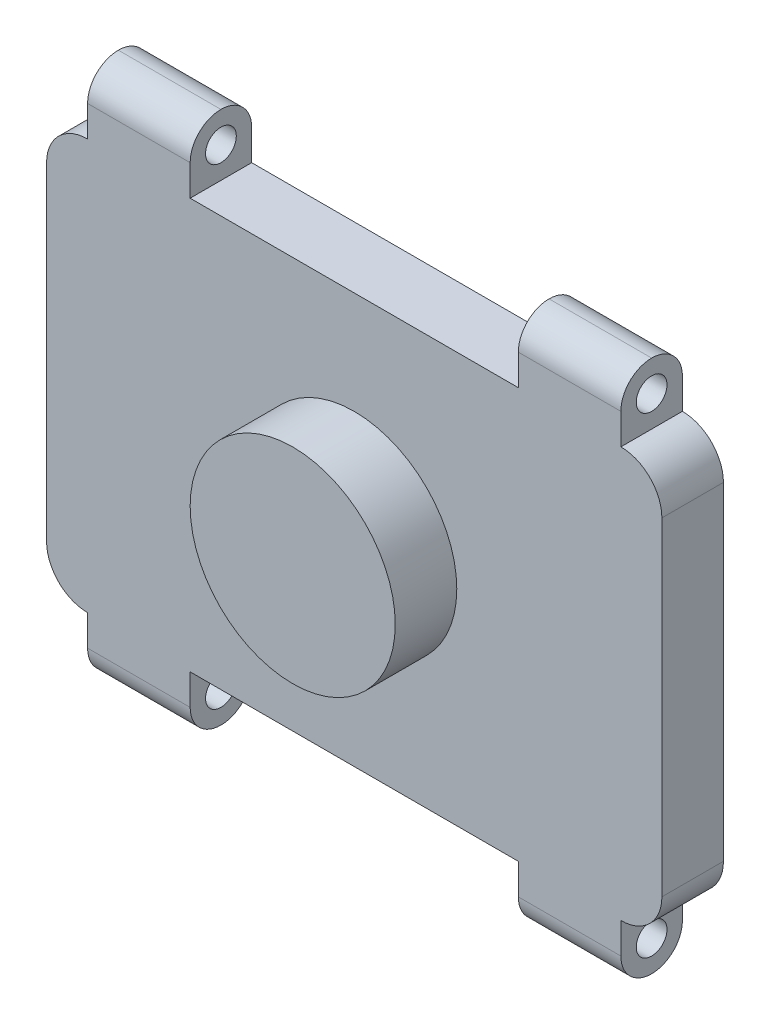
ISO-10303-21;
HEADER;
FILE_DESCRIPTION(('STEP AP214'),'2;1');
FILE_NAME('part.step','',(''),(''),'','','');
FILE_SCHEMA(('AUTOMOTIVE_DESIGN { 1 0 10303 214 1 1 1 1 }'));
ENDSEC;
DATA;
#1=APPLICATION_CONTEXT('core data for automotive mechanical design processes');
#2=APPLICATION_PROTOCOL_DEFINITION('international standard','automotive_design',2000,#1);
#3=PRODUCT_CONTEXT('',#1,'mechanical');
#4=PRODUCT('Part','Part','',(#3));
#5=PRODUCT_RELATED_PRODUCT_CATEGORY('part','',(#4));
#6=PRODUCT_DEFINITION_FORMATION('','',#4);
#7=PRODUCT_DEFINITION_CONTEXT('part definition',#1,'design');
#8=PRODUCT_DEFINITION('design','',#6,#7);
#9=PRODUCT_DEFINITION_SHAPE('','',#8);
#10=(LENGTH_UNIT() NAMED_UNIT(*) SI_UNIT(.MILLI.,.METRE.));
#11=(NAMED_UNIT(*) PLANE_ANGLE_UNIT() SI_UNIT($,.RADIAN.));
#12=(NAMED_UNIT(*) SI_UNIT($,.STERADIAN.) SOLID_ANGLE_UNIT());
#13=UNCERTAINTY_MEASURE_WITH_UNIT(LENGTH_MEASURE(1.E-05),#10,'distance_accuracy_value','');
#14=(GEOMETRIC_REPRESENTATION_CONTEXT(3) GLOBAL_UNCERTAINTY_ASSIGNED_CONTEXT((#13)) GLOBAL_UNIT_ASSIGNED_CONTEXT((#10,
#11,#12)) REPRESENTATION_CONTEXT('',''));
#15=CARTESIAN_POINT('',(0.,0.,0.));
#16=DIRECTION('',(0.,0.,1.));
#17=DIRECTION('',(1.,0.,0.));
#18=AXIS2_PLACEMENT_3D('',#15,#16,#17);
#19=CARTESIAN_POINT('',(-1654.84736029471,870.646766169154,300.));
#20=DIRECTION('',(1.,0.,0.));
#21=DIRECTION('',(0.,0.,-1.));
#22=AXIS2_PLACEMENT_3D('',#19,#20,#21);
#23=PLANE('',#22);
#24=DIRECTION('',(0.,-1.,0.));
#25=VECTOR('',#24,1.);
#26=CARTESIAN_POINT('',(-1654.84736029471,870.646766169154,0.));
#27=LINE('',#26,#25);
#28=CARTESIAN_POINT('',(-1654.84736029471,670.646766169154,0.));
#29=VERTEX_POINT('',#28);
#30=CARTESIAN_POINT('',(-1654.84736029471,-929.353233830846,0.));
#31=VERTEX_POINT('',#30);
#32=EDGE_CURVE('E274',#29,#31,#27,.T.);
#33=ORIENTED_EDGE('',*,*,#32,.T.);
#34=DIRECTION('',(0.,0.,-1.));
#35=VECTOR('',#34,1.);
#36=CARTESIAN_POINT('',(-1654.84736029471,-929.353233830846,300.));
#37=LINE('',#36,#35);
#38=CARTESIAN_POINT('',(-1654.84736029471,-929.353233830846,300.));
#39=VERTEX_POINT('',#38);
#40=EDGE_CURVE('E201',#31,#39,#37,.F.);
#41=ORIENTED_EDGE('',*,*,#40,.T.);
#42=DIRECTION('',(0.,-1.,0.));
#43=VECTOR('',#42,1.);
#44=CARTESIAN_POINT('',(-1654.84736029471,870.646766169154,300.));
#45=LINE('',#44,#43);
#46=CARTESIAN_POINT('',(-1654.84736029471,670.646766169154,300.));
#47=VERTEX_POINT('',#46);
#48=EDGE_CURVE('E275',#47,#39,#45,.T.);
#49=ORIENTED_EDGE('',*,*,#48,.F.);
#50=DIRECTION('',(0.,0.,-1.));
#51=VECTOR('',#50,1.);
#52=CARTESIAN_POINT('',(-1654.84736029471,670.646766169154,300.));
#53=LINE('',#52,#51);
#54=EDGE_CURVE('E206',#47,#29,#53,.T.);
#55=ORIENTED_EDGE('',*,*,#54,.T.);
#56=EDGE_LOOP('',(#33,#41,#49,#55));
#57=FACE_BOUND('',#56,.T.);
#58=ADVANCED_FACE('F33',(#57),#23,.F.);
#59=CARTESIAN_POINT('',(-1654.84736029471,-1129.35323383085,300.));
#60=DIRECTION('',(0.,1.,0.));
#61=DIRECTION('',(-1.,0.,0.));
#62=AXIS2_PLACEMENT_3D('',#59,#60,#61);
#63=PLANE('',#62);
#64=DIRECTION('',(1.,0.,0.));
#65=VECTOR('',#64,1.);
#66=CARTESIAN_POINT('',(-1654.84736029471,-1129.35323383085,300.));
#67=LINE('',#66,#65);
#68=CARTESIAN_POINT('',(-954.847360294714,-1129.35323383085,300.));
#69=VERTEX_POINT('',#68);
#70=CARTESIAN_POINT('',(645.152639705285,-1129.35323383085,300.));
#71=VERTEX_POINT('',#70);
#72=EDGE_CURVE('E278',#69,#71,#67,.T.);
#73=ORIENTED_EDGE('',*,*,#72,.F.);
#74=DIRECTION('',(0.,0.,1.));
#75=VECTOR('',#74,1.);
#76=CARTESIAN_POINT('',(-954.847360294714,-1129.35323383085,0.));
#77=LINE('',#76,#75);
#78=CARTESIAN_POINT('',(-954.847360294714,-1129.35323383085,0.));
#79=VERTEX_POINT('',#78);
#80=EDGE_CURVE('E226',#79,#69,#77,.T.);
#81=ORIENTED_EDGE('',*,*,#80,.F.);
#82=DIRECTION('',(1.,0.,0.));
#83=VECTOR('',#82,1.);
#84=CARTESIAN_POINT('',(-1654.84736029471,-1129.35323383085,0.));
#85=LINE('',#84,#83);
#86=CARTESIAN_POINT('',(645.152639705285,-1129.35323383085,0.));
#87=VERTEX_POINT('',#86);
#88=EDGE_CURVE('E287',#79,#87,#85,.T.);
#89=ORIENTED_EDGE('',*,*,#88,.T.);
#90=DIRECTION('',(0.,0.,1.));
#91=VECTOR('',#90,1.);
#92=CARTESIAN_POINT('',(645.152639705286,-1129.35323383085,0.));
#93=LINE('',#92,#91);
#94=EDGE_CURVE('E243',#87,#71,#93,.T.);
#95=ORIENTED_EDGE('',*,*,#94,.T.);
#96=EDGE_LOOP('',(#73,#81,#89,#95));
#97=FACE_BOUND('',#96,.T.);
#98=ADVANCED_FACE('F434',(#97),#63,.F.);
#99=CARTESIAN_POINT('',(1345.15263970529,870.646766169154,300.));
#100=DIRECTION('',(-1.,0.,0.));
#101=DIRECTION('',(0.,-1.,0.));
#102=AXIS2_PLACEMENT_3D('',#99,#100,#101);
#103=PLANE('',#102);
#104=DIRECTION('',(0.,1.,0.));
#105=VECTOR('',#104,1.);
#106=CARTESIAN_POINT('',(1345.15263970529,870.646766169154,300.));
#107=LINE('',#106,#105);
#108=CARTESIAN_POINT('',(1345.15263970529,-929.353233830845,300.));
#109=VERTEX_POINT('',#108);
#110=CARTESIAN_POINT('',(1345.15263970529,670.646766169154,300.));
#111=VERTEX_POINT('',#110);
#112=EDGE_CURVE('E281',#109,#111,#107,.T.);
#113=ORIENTED_EDGE('',*,*,#112,.F.);
#114=DIRECTION('',(0.,0.,-1.));
#115=VECTOR('',#114,1.);
#116=CARTESIAN_POINT('',(1345.15263970529,-929.353233830845,300.));
#117=LINE('',#116,#115);
#118=CARTESIAN_POINT('',(1345.15263970529,-929.353233830845,0.));
#119=VERTEX_POINT('',#118);
#120=EDGE_CURVE('E314',#109,#119,#117,.T.);
#121=ORIENTED_EDGE('',*,*,#120,.T.);
#122=DIRECTION('',(0.,1.,0.));
#123=VECTOR('',#122,1.);
#124=CARTESIAN_POINT('',(1345.15263970529,870.646766169154,0.));
#125=LINE('',#124,#123);
#126=CARTESIAN_POINT('',(1345.15263970529,670.646766169154,0.));
#127=VERTEX_POINT('',#126);
#128=EDGE_CURVE('E289',#119,#127,#125,.T.);
#129=ORIENTED_EDGE('',*,*,#128,.T.);
#130=DIRECTION('',(0.,0.,-1.));
#131=VECTOR('',#130,1.);
#132=CARTESIAN_POINT('',(1345.15263970529,670.646766169154,300.));
#133=LINE('',#132,#131);
#134=EDGE_CURVE('E312',#127,#111,#133,.F.);
#135=ORIENTED_EDGE('',*,*,#134,.T.);
#136=EDGE_LOOP('',(#113,#121,#129,#135));
#137=FACE_BOUND('',#136,.T.);
#138=ADVANCED_FACE('F440',(#137),#103,.F.);
#139=CARTESIAN_POINT('',(-1654.84736029471,870.646766169154,300.));
#140=DIRECTION('',(0.,-1.,0.));
#141=DIRECTION('',(0.,0.,-1.));
#142=AXIS2_PLACEMENT_3D('',#139,#140,#141);
#143=PLANE('',#142);
#144=DIRECTION('',(-1.,0.,0.));
#145=VECTOR('',#144,1.);
#146=CARTESIAN_POINT('',(-1654.84736029471,870.646766169154,300.));
#147=LINE('',#146,#145);
#148=CARTESIAN_POINT('',(645.152639705286,870.646766169154,300.));
#149=VERTEX_POINT('',#148);
#150=CARTESIAN_POINT('',(-954.847360294714,870.646766169154,300.));
#151=VERTEX_POINT('',#150);
#152=EDGE_CURVE('E284',#149,#151,#147,.T.);
#153=ORIENTED_EDGE('',*,*,#152,.F.);
#154=DIRECTION('',(0.,0.,1.));
#155=VECTOR('',#154,1.);
#156=CARTESIAN_POINT('',(645.152639705286,870.646766169154,0.));
#157=LINE('',#156,#155);
#158=CARTESIAN_POINT('',(645.152639705286,870.646766169154,0.));
#159=VERTEX_POINT('',#158);
#160=EDGE_CURVE('E256',#159,#149,#157,.T.);
#161=ORIENTED_EDGE('',*,*,#160,.F.);
#162=DIRECTION('',(-1.,0.,0.));
#163=VECTOR('',#162,1.);
#164=CARTESIAN_POINT('',(-1654.84736029471,870.646766169154,0.));
#165=LINE('',#164,#163);
#166=CARTESIAN_POINT('',(-954.847360294714,870.646766169154,0.));
#167=VERTEX_POINT('',#166);
#168=EDGE_CURVE('E279',#159,#167,#165,.T.);
#169=ORIENTED_EDGE('',*,*,#168,.T.);
#170=DIRECTION('',(0.,0.,1.));
#171=VECTOR('',#170,1.);
#172=CARTESIAN_POINT('',(-954.847360294714,870.646766169154,0.));
#173=LINE('',#172,#171);
#174=EDGE_CURVE('E268',#167,#151,#173,.T.);
#175=ORIENTED_EDGE('',*,*,#174,.T.);
#176=EDGE_LOOP('',(#153,#161,#169,#175));
#177=FACE_BOUND('',#176,.T.);
#178=ADVANCED_FACE('F496',(#177),#143,.F.);
#179=CARTESIAN_POINT('',(0.,0.,300.));
#180=DIRECTION('',(0.,0.,1.));
#181=DIRECTION('',(1.,0.,0.));
#182=AXIS2_PLACEMENT_3D('',#179,#180,#181);
#183=PLANE('',#182);
#184=CARTESIAN_POINT('',(-154.847360294714,-129.353233830846,300.));
#185=DIRECTION('',(0.,0.,1.));
#186=DIRECTION('',(1.,0.,0.));
#187=AXIS2_PLACEMENT_3D('',#184,#185,#186);
#188=CIRCLE('',#187,500.);
#189=CARTESIAN_POINT('',(345.152639705286,-129.353233830846,300.));
#190=VERTEX_POINT('',#189);
#191=EDGE_CURVE('E393',#190,#190,#188,.T.);
#192=ORIENTED_EDGE('',*,*,#191,.F.);
#193=EDGE_LOOP('',(#192));
#194=FACE_BOUND('',#193,.T.);
#195=DIRECTION('',(0.,-1.,0.));
#196=VECTOR('',#195,1.);
#197=CARTESIAN_POINT('',(-1454.84736029471,-1129.35323383085,300.));
#198=LINE('',#197,#196);
#199=CARTESIAN_POINT('',(-1454.84736029471,-1129.35323383085,300.));
#200=VERTEX_POINT('',#199);
#201=CARTESIAN_POINT('',(-1454.84736029471,-1279.35323383085,300.));
#202=VERTEX_POINT('',#201);
#203=EDGE_CURVE('E214',#200,#202,#198,.T.);
#204=ORIENTED_EDGE('',*,*,#203,.T.);
#205=DIRECTION('',(1.,0.,0.));
#206=VECTOR('',#205,1.);
#207=CARTESIAN_POINT('',(0.,-1279.35323383085,300.));
#208=LINE('',#207,#206);
#209=CARTESIAN_POINT('',(-954.847360294714,-1279.35323383085,300.));
#210=VERTEX_POINT('',#209);
#211=EDGE_CURVE('E357',#202,#210,#208,.T.);
#212=ORIENTED_EDGE('',*,*,#211,.T.);
#213=DIRECTION('',(0.,1.,0.));
#214=VECTOR('',#213,1.);
#215=CARTESIAN_POINT('',(-954.847360294714,-1129.35323383085,300.));
#216=LINE('',#215,#214);
#217=EDGE_CURVE('E224',#210,#69,#216,.T.);
#218=ORIENTED_EDGE('',*,*,#217,.T.);
#219=ORIENTED_EDGE('',*,*,#72,.T.);
#220=DIRECTION('',(0.,-1.,0.));
#221=VECTOR('',#220,1.);
#222=CARTESIAN_POINT('',(645.152639705286,-1129.35323383085,300.));
#223=LINE('',#222,#221);
#224=CARTESIAN_POINT('',(645.152639705286,-1279.35323383085,300.));
#225=VERTEX_POINT('',#224);
#226=EDGE_CURVE('E240',#71,#225,#223,.T.);
#227=ORIENTED_EDGE('',*,*,#226,.T.);
#228=DIRECTION('',(1.,0.,0.));
#229=VECTOR('',#228,1.);
#230=CARTESIAN_POINT('',(0.,-1279.35323383085,300.));
#231=LINE('',#230,#229);
#232=CARTESIAN_POINT('',(1145.15263970529,-1279.35323383085,300.));
#233=VERTEX_POINT('',#232);
#234=EDGE_CURVE('E355',#225,#233,#231,.T.);
#235=ORIENTED_EDGE('',*,*,#234,.T.);
#236=DIRECTION('',(0.,1.,0.));
#237=VECTOR('',#236,1.);
#238=CARTESIAN_POINT('',(1145.15263970529,-1129.35323383085,300.));
#239=LINE('',#238,#237);
#240=CARTESIAN_POINT('',(1145.15263970529,-1129.35323383085,300.));
#241=VERTEX_POINT('',#240);
#242=EDGE_CURVE('E236',#233,#241,#239,.T.);
#243=ORIENTED_EDGE('',*,*,#242,.T.);
#244=CARTESIAN_POINT('',(1145.15263970529,-929.353233830845,300.));
#245=DIRECTION('',(0.,0.,1.));
#246=DIRECTION('',(1.,0.,0.));
#247=AXIS2_PLACEMENT_3D('',#244,#245,#246);
#248=CIRCLE('',#247,200.);
#249=EDGE_CURVE('E308',#241,#109,#248,.T.);
#250=ORIENTED_EDGE('',*,*,#249,.T.);
#251=ORIENTED_EDGE('',*,*,#112,.T.);
#252=CARTESIAN_POINT('',(1145.15263970529,670.646766169154,300.));
#253=DIRECTION('',(0.,0.,1.));
#254=DIRECTION('',(1.,0.,0.));
#255=AXIS2_PLACEMENT_3D('',#252,#253,#254);
#256=CIRCLE('',#255,200.);
#257=CARTESIAN_POINT('',(1145.15263970529,870.646766169154,300.));
#258=VERTEX_POINT('',#257);
#259=EDGE_CURVE('E306',#111,#258,#256,.T.);
#260=ORIENTED_EDGE('',*,*,#259,.T.);
#261=DIRECTION('',(0.,1.,0.));
#262=VECTOR('',#261,1.);
#263=CARTESIAN_POINT('',(1145.15263970529,870.646766169154,300.));
#264=LINE('',#263,#262);
#265=CARTESIAN_POINT('',(1145.15263970529,1020.64676616915,300.));
#266=VERTEX_POINT('',#265);
#267=EDGE_CURVE('E249',#258,#266,#264,.T.);
#268=ORIENTED_EDGE('',*,*,#267,.T.);
#269=DIRECTION('',(-1.,0.,0.));
#270=VECTOR('',#269,1.);
#271=CARTESIAN_POINT('',(0.,1020.64676616915,300.));
#272=LINE('',#271,#270);
#273=CARTESIAN_POINT('',(645.152639705286,1020.64676616915,300.));
#274=VERTEX_POINT('',#273);
#275=EDGE_CURVE('E353',#266,#274,#272,.T.);
#276=ORIENTED_EDGE('',*,*,#275,.T.);
#277=DIRECTION('',(0.,-1.,0.));
#278=VECTOR('',#277,1.);
#279=CARTESIAN_POINT('',(645.152639705286,870.646766169154,300.));
#280=LINE('',#279,#278);
#281=EDGE_CURVE('E254',#274,#149,#280,.T.);
#282=ORIENTED_EDGE('',*,*,#281,.T.);
#283=ORIENTED_EDGE('',*,*,#152,.T.);
#284=DIRECTION('',(0.,1.,0.));
#285=VECTOR('',#284,1.);
#286=CARTESIAN_POINT('',(-954.847360294714,870.646766169154,300.));
#287=LINE('',#286,#285);
#288=CARTESIAN_POINT('',(-954.847360294714,1020.64676616915,300.));
#289=VERTEX_POINT('',#288);
#290=EDGE_CURVE('E266',#151,#289,#287,.T.);
#291=ORIENTED_EDGE('',*,*,#290,.T.);
#292=DIRECTION('',(-1.,0.,0.));
#293=VECTOR('',#292,1.);
#294=CARTESIAN_POINT('',(0.,1020.64676616915,300.));
#295=LINE('',#294,#293);
#296=CARTESIAN_POINT('',(-1454.84736029471,1020.64676616915,300.));
#297=VERTEX_POINT('',#296);
#298=EDGE_CURVE('E351',#289,#297,#295,.T.);
#299=ORIENTED_EDGE('',*,*,#298,.T.);
#300=DIRECTION('',(0.,-1.,0.));
#301=VECTOR('',#300,1.);
#302=CARTESIAN_POINT('',(-1454.84736029471,870.646766169154,300.));
#303=LINE('',#302,#301);
#304=CARTESIAN_POINT('',(-1454.84736029471,870.646766169154,300.));
#305=VERTEX_POINT('',#304);
#306=EDGE_CURVE('E262',#297,#305,#303,.T.);
#307=ORIENTED_EDGE('',*,*,#306,.T.);
#308=CARTESIAN_POINT('',(-1454.84736029471,670.646766169154,300.));
#309=DIRECTION('',(0.,0.,1.));
#310=DIRECTION('',(1.,0.,0.));
#311=AXIS2_PLACEMENT_3D('',#308,#309,#310);
#312=CIRCLE('',#311,200.);
#313=EDGE_CURVE('E304',#305,#47,#312,.T.);
#314=ORIENTED_EDGE('',*,*,#313,.T.);
#315=ORIENTED_EDGE('',*,*,#48,.T.);
#316=CARTESIAN_POINT('',(-1454.84736029471,-929.353233830846,300.));
#317=DIRECTION('',(0.,0.,1.));
#318=DIRECTION('',(1.,0.,0.));
#319=AXIS2_PLACEMENT_3D('',#316,#317,#318);
#320=CIRCLE('',#319,200.);
#321=EDGE_CURVE('E310',#39,#200,#320,.T.);
#322=ORIENTED_EDGE('',*,*,#321,.T.);
#323=EDGE_LOOP('',(#204,#212,#218,#219,#227,#235,#243,#250,#251,#260,#268,#276,#282,#283,#291,
#299,#307,#314,#315,#322));
#324=FACE_BOUND('',#323,.T.);
#325=ADVANCED_FACE('F510',(#194,#324),#183,.T.);
#326=CARTESIAN_POINT('',(0.,0.,0.));
#327=DIRECTION('',(0.,0.,1.));
#328=DIRECTION('',(1.,0.,0.));
#329=AXIS2_PLACEMENT_3D('',#326,#327,#328);
#330=PLANE('',#329);
#331=DIRECTION('',(0.,1.,0.));
#332=VECTOR('',#331,1.);
#333=CARTESIAN_POINT('',(-954.847360294714,-1129.35323383085,0.));
#334=LINE('',#333,#332);
#335=CARTESIAN_POINT('',(-954.847360294714,-1279.35323383085,0.));
#336=VERTEX_POINT('',#335);
#337=EDGE_CURVE('E223',#336,#79,#334,.T.);
#338=ORIENTED_EDGE('',*,*,#337,.F.);
#339=DIRECTION('',(1.,0.,0.));
#340=VECTOR('',#339,1.);
#341=CARTESIAN_POINT('',(-1454.84736029471,-1279.35323383085,0.));
#342=LINE('',#341,#340);
#343=CARTESIAN_POINT('',(-1454.84736029471,-1279.35323383085,0.));
#344=VERTEX_POINT('',#343);
#345=EDGE_CURVE('E222',#336,#344,#342,.F.);
#346=ORIENTED_EDGE('',*,*,#345,.T.);
#347=DIRECTION('',(0.,-1.,0.));
#348=VECTOR('',#347,1.);
#349=CARTESIAN_POINT('',(-1454.84736029471,-1129.35323383085,0.));
#350=LINE('',#349,#348);
#351=CARTESIAN_POINT('',(-1454.84736029471,-1129.35323383085,0.));
#352=VERTEX_POINT('',#351);
#353=EDGE_CURVE('E212',#352,#344,#350,.T.);
#354=ORIENTED_EDGE('',*,*,#353,.F.);
#355=CARTESIAN_POINT('',(-1454.84736029471,-929.353233830846,0.));
#356=DIRECTION('',(0.,0.,1.));
#357=DIRECTION('',(1.,0.,0.));
#358=AXIS2_PLACEMENT_3D('',#355,#356,#357);
#359=CIRCLE('',#358,200.);
#360=EDGE_CURVE('E195',#352,#31,#359,.F.);
#361=ORIENTED_EDGE('',*,*,#360,.T.);
#362=ORIENTED_EDGE('',*,*,#32,.F.);
#363=CARTESIAN_POINT('',(-1454.84736029471,670.646766169154,0.));
#364=DIRECTION('',(0.,0.,1.));
#365=DIRECTION('',(1.,0.,0.));
#366=AXIS2_PLACEMENT_3D('',#363,#364,#365);
#367=CIRCLE('',#366,200.);
#368=CARTESIAN_POINT('',(-1454.84736029471,870.646766169154,0.));
#369=VERTEX_POINT('',#368);
#370=EDGE_CURVE('E215',#29,#369,#367,.F.);
#371=ORIENTED_EDGE('',*,*,#370,.T.);
#372=DIRECTION('',(0.,-1.,0.));
#373=VECTOR('',#372,1.);
#374=CARTESIAN_POINT('',(-1454.84736029471,870.646766169154,0.));
#375=LINE('',#374,#373);
#376=CARTESIAN_POINT('',(-1454.84736029471,1020.64676616915,0.));
#377=VERTEX_POINT('',#376);
#378=EDGE_CURVE('E263',#377,#369,#375,.T.);
#379=ORIENTED_EDGE('',*,*,#378,.F.);
#380=DIRECTION('',(-1.,0.,0.));
#381=VECTOR('',#380,1.);
#382=CARTESIAN_POINT('',(-954.847360294714,1020.64676616915,0.));
#383=LINE('',#382,#381);
#384=CARTESIAN_POINT('',(-954.847360294714,1020.64676616915,0.));
#385=VERTEX_POINT('',#384);
#386=EDGE_CURVE('E337',#377,#385,#383,.F.);
#387=ORIENTED_EDGE('',*,*,#386,.T.);
#388=DIRECTION('',(0.,1.,0.));
#389=VECTOR('',#388,1.);
#390=CARTESIAN_POINT('',(-954.847360294714,870.646766169154,0.));
#391=LINE('',#390,#389);
#392=EDGE_CURVE('E265',#167,#385,#391,.T.);
#393=ORIENTED_EDGE('',*,*,#392,.F.);
#394=ORIENTED_EDGE('',*,*,#168,.F.);
#395=DIRECTION('',(0.,-1.,0.));
#396=VECTOR('',#395,1.);
#397=CARTESIAN_POINT('',(645.152639705286,870.646766169154,0.));
#398=LINE('',#397,#396);
#399=CARTESIAN_POINT('',(645.152639705286,1020.64676616915,0.));
#400=VERTEX_POINT('',#399);
#401=EDGE_CURVE('E253',#400,#159,#398,.T.);
#402=ORIENTED_EDGE('',*,*,#401,.F.);
#403=DIRECTION('',(-1.,0.,0.));
#404=VECTOR('',#403,1.);
#405=CARTESIAN_POINT('',(1145.15263970529,1020.64676616915,0.));
#406=LINE('',#405,#404);
#407=CARTESIAN_POINT('',(1145.15263970529,1020.64676616915,0.));
#408=VERTEX_POINT('',#407);
#409=EDGE_CURVE('E340',#400,#408,#406,.F.);
#410=ORIENTED_EDGE('',*,*,#409,.T.);
#411=DIRECTION('',(0.,1.,0.));
#412=VECTOR('',#411,1.);
#413=CARTESIAN_POINT('',(1145.15263970529,870.646766169154,0.));
#414=LINE('',#413,#412);
#415=CARTESIAN_POINT('',(1145.15263970529,870.646766169154,0.));
#416=VERTEX_POINT('',#415);
#417=EDGE_CURVE('E250',#416,#408,#414,.T.);
#418=ORIENTED_EDGE('',*,*,#417,.F.);
#419=CARTESIAN_POINT('',(1145.15263970529,670.646766169154,0.));
#420=DIRECTION('',(0.,0.,1.));
#421=DIRECTION('',(1.,0.,0.));
#422=AXIS2_PLACEMENT_3D('',#419,#420,#421);
#423=CIRCLE('',#422,200.);
#424=EDGE_CURVE('E297',#416,#127,#423,.F.);
#425=ORIENTED_EDGE('',*,*,#424,.T.);
#426=ORIENTED_EDGE('',*,*,#128,.F.);
#427=CARTESIAN_POINT('',(1145.15263970529,-929.353233830845,0.));
#428=DIRECTION('',(0.,0.,1.));
#429=DIRECTION('',(1.,0.,0.));
#430=AXIS2_PLACEMENT_3D('',#427,#428,#429);
#431=CIRCLE('',#430,200.);
#432=CARTESIAN_POINT('',(1145.15263970529,-1129.35323383085,0.));
#433=VERTEX_POINT('',#432);
#434=EDGE_CURVE('E207',#119,#433,#431,.F.);
#435=ORIENTED_EDGE('',*,*,#434,.T.);
#436=DIRECTION('',(0.,1.,0.));
#437=VECTOR('',#436,1.);
#438=CARTESIAN_POINT('',(1145.15263970529,-1129.35323383085,0.));
#439=LINE('',#438,#437);
#440=CARTESIAN_POINT('',(1145.15263970529,-1279.35323383085,0.));
#441=VERTEX_POINT('',#440);
#442=EDGE_CURVE('E237',#441,#433,#439,.T.);
#443=ORIENTED_EDGE('',*,*,#442,.F.);
#444=DIRECTION('',(1.,0.,0.));
#445=VECTOR('',#444,1.);
#446=CARTESIAN_POINT('',(645.152639705286,-1279.35323383085,0.));
#447=LINE('',#446,#445);
#448=CARTESIAN_POINT('',(645.152639705286,-1279.35323383085,0.));
#449=VERTEX_POINT('',#448);
#450=EDGE_CURVE('E343',#441,#449,#447,.F.);
#451=ORIENTED_EDGE('',*,*,#450,.T.);
#452=DIRECTION('',(0.,-1.,0.));
#453=VECTOR('',#452,1.);
#454=CARTESIAN_POINT('',(645.152639705286,-1129.35323383085,0.));
#455=LINE('',#454,#453);
#456=EDGE_CURVE('E239',#87,#449,#455,.T.);
#457=ORIENTED_EDGE('',*,*,#456,.F.);
#458=ORIENTED_EDGE('',*,*,#88,.F.);
#459=EDGE_LOOP('',(#338,#346,#354,#361,#362,#371,#379,#387,#393,#394,#402,#410,#418,#425,#426,
#435,#443,#451,#457,#458));
#460=FACE_BOUND('',#459,.T.);
#461=ADVANCED_FACE('F220',(#460),#330,.F.);
#462=CARTESIAN_POINT('',(-1454.84736029471,-929.353233830846,300.));
#463=DIRECTION('',(0.,0.,-1.));
#464=DIRECTION('',(-1.,0.,0.));
#465=AXIS2_PLACEMENT_3D('',#462,#463,#464);
#466=CYLINDRICAL_SURFACE('',#465,200.);
#467=ORIENTED_EDGE('',*,*,#321,.F.);
#468=ORIENTED_EDGE('',*,*,#40,.F.);
#469=ORIENTED_EDGE('',*,*,#360,.F.);
#470=DIRECTION('',(0.,0.,-1.));
#471=VECTOR('',#470,1.);
#472=CARTESIAN_POINT('',(-1454.84736029471,-1129.35323383085,300.));
#473=LINE('',#472,#471);
#474=EDGE_CURVE('E199',#200,#352,#473,.T.);
#475=ORIENTED_EDGE('',*,*,#474,.F.);
#476=EDGE_LOOP('',(#467,#468,#469,#475));
#477=FACE_BOUND('',#476,.T.);
#478=ADVANCED_FACE('F198',(#477),#466,.T.);
#479=CARTESIAN_POINT('',(1145.15263970529,-929.353233830845,300.));
#480=DIRECTION('',(0.,0.,-1.));
#481=DIRECTION('',(-1.,0.,0.));
#482=AXIS2_PLACEMENT_3D('',#479,#480,#481);
#483=CYLINDRICAL_SURFACE('',#482,200.);
#484=ORIENTED_EDGE('',*,*,#249,.F.);
#485=DIRECTION('',(0.,0.,-1.));
#486=VECTOR('',#485,1.);
#487=CARTESIAN_POINT('',(1145.15263970529,-1129.35323383085,300.));
#488=LINE('',#487,#486);
#489=EDGE_CURVE('E216',#433,#241,#488,.F.);
#490=ORIENTED_EDGE('',*,*,#489,.F.);
#491=ORIENTED_EDGE('',*,*,#434,.F.);
#492=ORIENTED_EDGE('',*,*,#120,.F.);
#493=EDGE_LOOP('',(#484,#490,#491,#492));
#494=FACE_BOUND('',#493,.T.);
#495=ADVANCED_FACE('F447',(#494),#483,.T.);
#496=CARTESIAN_POINT('',(1145.15263970529,670.646766169154,300.));
#497=DIRECTION('',(0.,0.,-1.));
#498=DIRECTION('',(-1.,0.,0.));
#499=AXIS2_PLACEMENT_3D('',#496,#497,#498);
#500=CYLINDRICAL_SURFACE('',#499,200.);
#501=ORIENTED_EDGE('',*,*,#259,.F.);
#502=ORIENTED_EDGE('',*,*,#134,.F.);
#503=ORIENTED_EDGE('',*,*,#424,.F.);
#504=DIRECTION('',(0.,0.,-1.));
#505=VECTOR('',#504,1.);
#506=CARTESIAN_POINT('',(1145.15263970529,870.646766169154,300.));
#507=LINE('',#506,#505);
#508=EDGE_CURVE('E320',#258,#416,#507,.T.);
#509=ORIENTED_EDGE('',*,*,#508,.F.);
#510=EDGE_LOOP('',(#501,#502,#503,#509));
#511=FACE_BOUND('',#510,.T.);
#512=ADVANCED_FACE('F429',(#511),#500,.T.);
#513=CARTESIAN_POINT('',(-1454.84736029471,670.646766169154,300.));
#514=DIRECTION('',(0.,0.,-1.));
#515=DIRECTION('',(-1.,0.,0.));
#516=AXIS2_PLACEMENT_3D('',#513,#514,#515);
#517=CYLINDRICAL_SURFACE('',#516,200.);
#518=ORIENTED_EDGE('',*,*,#313,.F.);
#519=DIRECTION('',(0.,0.,-1.));
#520=VECTOR('',#519,1.);
#521=CARTESIAN_POINT('',(-1454.84736029471,870.646766169154,300.));
#522=LINE('',#521,#520);
#523=EDGE_CURVE('E317',#369,#305,#522,.F.);
#524=ORIENTED_EDGE('',*,*,#523,.F.);
#525=ORIENTED_EDGE('',*,*,#370,.F.);
#526=ORIENTED_EDGE('',*,*,#54,.F.);
#527=EDGE_LOOP('',(#518,#524,#525,#526));
#528=FACE_BOUND('',#527,.T.);
#529=ADVANCED_FACE('F420',(#528),#517,.T.);
#530=CARTESIAN_POINT('',(-1454.84736029471,870.646766169154,0.));
#531=DIRECTION('',(-1.,0.,0.));
#532=DIRECTION('',(0.,0.,1.));
#533=AXIS2_PLACEMENT_3D('',#530,#531,#532);
#534=PLANE('',#533);
#535=CARTESIAN_POINT('',(-1454.84736029471,1020.64676616915,150.));
#536=DIRECTION('',(-1.,0.,0.));
#537=DIRECTION('',(0.,0.,1.));
#538=AXIS2_PLACEMENT_3D('',#535,#536,#537);
#539=CIRCLE('',#538,75.);
#540=CARTESIAN_POINT('',(-1454.84736029471,1020.64676616915,225.));
#541=VERTEX_POINT('',#540);
#542=EDGE_CURVE('E230',#541,#541,#539,.T.);
#543=ORIENTED_EDGE('',*,*,#542,.F.);
#544=EDGE_LOOP('',(#543));
#545=FACE_BOUND('',#544,.T.);
#546=CARTESIAN_POINT('',(-1454.84736029471,1020.64676616915,150.));
#547=DIRECTION('',(-1.,0.,0.));
#548=DIRECTION('',(0.,0.,1.));
#549=AXIS2_PLACEMENT_3D('',#546,#547,#548);
#550=CIRCLE('',#549,150.);
#551=CARTESIAN_POINT('',(-1454.84736029471,1170.64676616915,150.));
#552=VERTEX_POINT('',#551);
#553=EDGE_CURVE('E56',#297,#552,#550,.T.);
#554=ORIENTED_EDGE('',*,*,#553,.T.);
#555=CARTESIAN_POINT('',(-1454.84736029471,1020.64676616915,150.));
#556=DIRECTION('',(-1.,0.,0.));
#557=DIRECTION('',(0.,0.,1.));
#558=AXIS2_PLACEMENT_3D('',#555,#556,#557);
#559=CIRCLE('',#558,150.);
#560=EDGE_CURVE('E376',#552,#377,#559,.T.);
#561=ORIENTED_EDGE('',*,*,#560,.T.);
#562=ORIENTED_EDGE('',*,*,#378,.T.);
#563=ORIENTED_EDGE('',*,*,#523,.T.);
#564=ORIENTED_EDGE('',*,*,#306,.F.);
#565=EDGE_LOOP('',(#554,#561,#562,#563,#564));
#566=FACE_BOUND('',#565,.T.);
#567=ADVANCED_FACE('F417',(#545,#566),#534,.T.);
#568=CARTESIAN_POINT('',(-954.847360294714,870.646766169154,0.));
#569=DIRECTION('',(1.,0.,0.));
#570=DIRECTION('',(0.,0.,-1.));
#571=AXIS2_PLACEMENT_3D('',#568,#569,#570);
#572=PLANE('',#571);
#573=CARTESIAN_POINT('',(-954.847360294714,1020.64676616915,150.));
#574=DIRECTION('',(1.,0.,0.));
#575=DIRECTION('',(0.,0.,-1.));
#576=AXIS2_PLACEMENT_3D('',#573,#574,#575);
#577=CIRCLE('',#576,75.);
#578=CARTESIAN_POINT('',(-954.847360294714,1020.64676616915,75.));
#579=VERTEX_POINT('',#578);
#580=EDGE_CURVE('E408',#579,#579,#577,.T.);
#581=ORIENTED_EDGE('',*,*,#580,.F.);
#582=EDGE_LOOP('',(#581));
#583=FACE_BOUND('',#582,.T.);
#584=ORIENTED_EDGE('',*,*,#392,.T.);
#585=CARTESIAN_POINT('',(-954.847360294714,1020.64676616915,150.));
#586=DIRECTION('',(1.,0.,0.));
#587=DIRECTION('',(0.,0.,-1.));
#588=AXIS2_PLACEMENT_3D('',#585,#586,#587);
#589=CIRCLE('',#588,150.);
#590=CARTESIAN_POINT('',(-954.847360294714,1170.64676616915,150.));
#591=VERTEX_POINT('',#590);
#592=EDGE_CURVE('E11',#385,#591,#589,.T.);
#593=ORIENTED_EDGE('',*,*,#592,.T.);
#594=CARTESIAN_POINT('',(-954.847360294714,1020.64676616915,150.));
#595=DIRECTION('',(1.,0.,0.));
#596=DIRECTION('',(0.,0.,-1.));
#597=AXIS2_PLACEMENT_3D('',#594,#595,#596);
#598=CIRCLE('',#597,150.);
#599=EDGE_CURVE('E42',#591,#289,#598,.T.);
#600=ORIENTED_EDGE('',*,*,#599,.T.);
#601=ORIENTED_EDGE('',*,*,#290,.F.);
#602=ORIENTED_EDGE('',*,*,#174,.F.);
#603=EDGE_LOOP('',(#584,#593,#600,#601,#602));
#604=FACE_BOUND('',#603,.T.);
#605=ADVANCED_FACE('F419',(#583,#604),#572,.T.);
#606=CARTESIAN_POINT('',(645.152639705286,870.646766169154,0.));
#607=DIRECTION('',(-1.,0.,0.));
#608=DIRECTION('',(0.,0.,1.));
#609=AXIS2_PLACEMENT_3D('',#606,#607,#608);
#610=PLANE('',#609);
#611=CARTESIAN_POINT('',(645.152639705286,1020.64676616915,150.));
#612=DIRECTION('',(-1.,0.,0.));
#613=DIRECTION('',(0.,0.,1.));
#614=AXIS2_PLACEMENT_3D('',#611,#612,#613);
#615=CIRCLE('',#614,75.);
#616=CARTESIAN_POINT('',(645.152639705286,1020.64676616915,225.));
#617=VERTEX_POINT('',#616);
#618=EDGE_CURVE('E327',#617,#617,#615,.T.);
#619=ORIENTED_EDGE('',*,*,#618,.F.);
#620=EDGE_LOOP('',(#619));
#621=FACE_BOUND('',#620,.T.);
#622=CARTESIAN_POINT('',(645.152639705286,1020.64676616915,150.));
#623=DIRECTION('',(-1.,0.,0.));
#624=DIRECTION('',(0.,0.,1.));
#625=AXIS2_PLACEMENT_3D('',#622,#623,#624);
#626=CIRCLE('',#625,150.);
#627=CARTESIAN_POINT('',(645.152639705286,1170.64676616915,150.));
#628=VERTEX_POINT('',#627);
#629=EDGE_CURVE('E367',#274,#628,#626,.T.);
#630=ORIENTED_EDGE('',*,*,#629,.T.);
#631=CARTESIAN_POINT('',(645.152639705286,1020.64676616915,150.));
#632=DIRECTION('',(-1.,0.,0.));
#633=DIRECTION('',(0.,0.,1.));
#634=AXIS2_PLACEMENT_3D('',#631,#632,#633);
#635=CIRCLE('',#634,150.);
#636=EDGE_CURVE('E369',#628,#400,#635,.T.);
#637=ORIENTED_EDGE('',*,*,#636,.T.);
#638=ORIENTED_EDGE('',*,*,#401,.T.);
#639=ORIENTED_EDGE('',*,*,#160,.T.);
#640=ORIENTED_EDGE('',*,*,#281,.F.);
#641=EDGE_LOOP('',(#630,#637,#638,#639,#640));
#642=FACE_BOUND('',#641,.T.);
#643=ADVANCED_FACE('F426',(#621,#642),#610,.T.);
#644=CARTESIAN_POINT('',(1145.15263970529,870.646766169154,0.));
#645=DIRECTION('',(1.,0.,0.));
#646=DIRECTION('',(0.,0.,-1.));
#647=AXIS2_PLACEMENT_3D('',#644,#645,#646);
#648=PLANE('',#647);
#649=CARTESIAN_POINT('',(1145.15263970529,1020.64676616915,150.));
#650=DIRECTION('',(1.,0.,0.));
#651=DIRECTION('',(0.,0.,-1.));
#652=AXIS2_PLACEMENT_3D('',#649,#650,#651);
#653=CIRCLE('',#652,75.);
#654=CARTESIAN_POINT('',(1145.15263970529,1020.64676616915,75.));
#655=VERTEX_POINT('',#654);
#656=EDGE_CURVE('E324',#655,#655,#653,.T.);
#657=ORIENTED_EDGE('',*,*,#656,.F.);
#658=EDGE_LOOP('',(#657));
#659=FACE_BOUND('',#658,.T.);
#660=ORIENTED_EDGE('',*,*,#417,.T.);
#661=CARTESIAN_POINT('',(1145.15263970529,1020.64676616915,150.));
#662=DIRECTION('',(1.,0.,0.));
#663=DIRECTION('',(0.,0.,-1.));
#664=AXIS2_PLACEMENT_3D('',#661,#662,#663);
#665=CIRCLE('',#664,150.);
#666=CARTESIAN_POINT('',(1145.15263970529,1170.64676616915,150.));
#667=VERTEX_POINT('',#666);
#668=EDGE_CURVE('E373',#408,#667,#665,.T.);
#669=ORIENTED_EDGE('',*,*,#668,.T.);
#670=CARTESIAN_POINT('',(1145.15263970529,1020.64676616915,150.));
#671=DIRECTION('',(1.,0.,0.));
#672=DIRECTION('',(0.,0.,-1.));
#673=AXIS2_PLACEMENT_3D('',#670,#671,#672);
#674=CIRCLE('',#673,150.);
#675=EDGE_CURVE('E371',#667,#266,#674,.T.);
#676=ORIENTED_EDGE('',*,*,#675,.T.);
#677=ORIENTED_EDGE('',*,*,#267,.F.);
#678=ORIENTED_EDGE('',*,*,#508,.T.);
#679=EDGE_LOOP('',(#660,#669,#676,#677,#678));
#680=FACE_BOUND('',#679,.T.);
#681=ADVANCED_FACE('F504',(#659,#680),#648,.T.);
#682=CARTESIAN_POINT('',(1145.15263970529,-1129.35323383085,0.));
#683=DIRECTION('',(1.,0.,0.));
#684=DIRECTION('',(0.,0.,-1.));
#685=AXIS2_PLACEMENT_3D('',#682,#683,#684);
#686=PLANE('',#685);
#687=CARTESIAN_POINT('',(1145.15263970529,-1279.35323383085,150.));
#688=DIRECTION('',(1.,0.,0.));
#689=DIRECTION('',(0.,0.,-1.));
#690=AXIS2_PLACEMENT_3D('',#687,#688,#689);
#691=CIRCLE('',#690,75.);
#692=CARTESIAN_POINT('',(1145.15263970529,-1279.35323383085,75.));
#693=VERTEX_POINT('',#692);
#694=EDGE_CURVE('E328',#693,#693,#691,.T.);
#695=ORIENTED_EDGE('',*,*,#694,.F.);
#696=EDGE_LOOP('',(#695));
#697=FACE_BOUND('',#696,.T.);
#698=CARTESIAN_POINT('',(1145.15263970529,-1279.35323383085,150.));
#699=DIRECTION('',(1.,0.,0.));
#700=DIRECTION('',(0.,0.,-1.));
#701=AXIS2_PLACEMENT_3D('',#698,#699,#700);
#702=CIRCLE('',#701,150.);
#703=CARTESIAN_POINT('',(1145.15263970529,-1429.35323383085,150.));
#704=VERTEX_POINT('',#703);
#705=EDGE_CURVE('E359',#233,#704,#702,.T.);
#706=ORIENTED_EDGE('',*,*,#705,.T.);
#707=CARTESIAN_POINT('',(1145.15263970529,-1279.35323383085,150.));
#708=DIRECTION('',(1.,0.,0.));
#709=DIRECTION('',(0.,0.,-1.));
#710=AXIS2_PLACEMENT_3D('',#707,#708,#709);
#711=CIRCLE('',#710,150.);
#712=EDGE_CURVE('E361',#704,#441,#711,.T.);
#713=ORIENTED_EDGE('',*,*,#712,.T.);
#714=ORIENTED_EDGE('',*,*,#442,.T.);
#715=ORIENTED_EDGE('',*,*,#489,.T.);
#716=ORIENTED_EDGE('',*,*,#242,.F.);
#717=EDGE_LOOP('',(#706,#713,#714,#715,#716));
#718=FACE_BOUND('',#717,.T.);
#719=ADVANCED_FACE('F517',(#697,#718),#686,.T.);
#720=CARTESIAN_POINT('',(645.152639705286,-1129.35323383085,0.));
#721=DIRECTION('',(-1.,0.,0.));
#722=DIRECTION('',(0.,0.,1.));
#723=AXIS2_PLACEMENT_3D('',#720,#721,#722);
#724=PLANE('',#723);
#725=CARTESIAN_POINT('',(645.152639705286,-1279.35323383085,150.));
#726=DIRECTION('',(-1.,0.,0.));
#727=DIRECTION('',(0.,0.,1.));
#728=AXIS2_PLACEMENT_3D('',#725,#726,#727);
#729=CIRCLE('',#728,75.);
#730=CARTESIAN_POINT('',(645.152639705286,-1279.35323383085,225.));
#731=VERTEX_POINT('',#730);
#732=EDGE_CURVE('E402',#731,#731,#729,.T.);
#733=ORIENTED_EDGE('',*,*,#732,.F.);
#734=EDGE_LOOP('',(#733));
#735=FACE_BOUND('',#734,.T.);
#736=ORIENTED_EDGE('',*,*,#456,.T.);
#737=CARTESIAN_POINT('',(645.152639705286,-1279.35323383085,150.));
#738=DIRECTION('',(-1.,0.,0.));
#739=DIRECTION('',(0.,0.,1.));
#740=AXIS2_PLACEMENT_3D('',#737,#738,#739);
#741=CIRCLE('',#740,150.);
#742=CARTESIAN_POINT('',(645.152639705286,-1429.35323383085,150.));
#743=VERTEX_POINT('',#742);
#744=EDGE_CURVE('E365',#449,#743,#741,.T.);
#745=ORIENTED_EDGE('',*,*,#744,.T.);
#746=CARTESIAN_POINT('',(645.152639705286,-1279.35323383085,150.));
#747=DIRECTION('',(-1.,0.,0.));
#748=DIRECTION('',(0.,0.,1.));
#749=AXIS2_PLACEMENT_3D('',#746,#747,#748);
#750=CIRCLE('',#749,150.);
#751=EDGE_CURVE('E363',#743,#225,#750,.T.);
#752=ORIENTED_EDGE('',*,*,#751,.T.);
#753=ORIENTED_EDGE('',*,*,#226,.F.);
#754=ORIENTED_EDGE('',*,*,#94,.F.);
#755=EDGE_LOOP('',(#736,#745,#752,#753,#754));
#756=FACE_BOUND('',#755,.T.);
#757=ADVANCED_FACE('F524',(#735,#756),#724,.T.);
#758=CARTESIAN_POINT('',(-954.847360294714,-1129.35323383085,0.));
#759=DIRECTION('',(1.,0.,0.));
#760=DIRECTION('',(0.,0.,-1.));
#761=AXIS2_PLACEMENT_3D('',#758,#759,#760);
#762=PLANE('',#761);
#763=CARTESIAN_POINT('',(-954.847360294714,-1279.35323383085,150.));
#764=DIRECTION('',(1.,0.,0.));
#765=DIRECTION('',(0.,0.,-1.));
#766=AXIS2_PLACEMENT_3D('',#763,#764,#765);
#767=CIRCLE('',#766,75.);
#768=CARTESIAN_POINT('',(-954.847360294714,-1279.35323383085,75.));
#769=VERTEX_POINT('',#768);
#770=EDGE_CURVE('E332',#769,#769,#767,.T.);
#771=ORIENTED_EDGE('',*,*,#770,.F.);
#772=EDGE_LOOP('',(#771));
#773=FACE_BOUND('',#772,.T.);
#774=CARTESIAN_POINT('',(-954.847360294714,-1279.35323383085,150.));
#775=DIRECTION('',(1.,0.,0.));
#776=DIRECTION('',(0.,0.,-1.));
#777=AXIS2_PLACEMENT_3D('',#774,#775,#776);
#778=CIRCLE('',#777,150.);
#779=CARTESIAN_POINT('',(-954.847360294714,-1429.35323383085,150.));
#780=VERTEX_POINT('',#779);
#781=EDGE_CURVE('E323',#210,#780,#778,.T.);
#782=ORIENTED_EDGE('',*,*,#781,.T.);
#783=CARTESIAN_POINT('',(-954.847360294714,-1279.35323383085,150.));
#784=DIRECTION('',(1.,0.,0.));
#785=DIRECTION('',(0.,0.,-1.));
#786=AXIS2_PLACEMENT_3D('',#783,#784,#785);
#787=CIRCLE('',#786,150.);
#788=EDGE_CURVE('E335',#780,#336,#787,.T.);
#789=ORIENTED_EDGE('',*,*,#788,.T.);
#790=ORIENTED_EDGE('',*,*,#337,.T.);
#791=ORIENTED_EDGE('',*,*,#80,.T.);
#792=ORIENTED_EDGE('',*,*,#217,.F.);
#793=EDGE_LOOP('',(#782,#789,#790,#791,#792));
#794=FACE_BOUND('',#793,.T.);
#795=ADVANCED_FACE('F528',(#773,#794),#762,.T.);
#796=CARTESIAN_POINT('',(-1454.84736029471,-1129.35323383085,0.));
#797=DIRECTION('',(-1.,0.,0.));
#798=DIRECTION('',(0.,0.,1.));
#799=AXIS2_PLACEMENT_3D('',#796,#797,#798);
#800=PLANE('',#799);
#801=CARTESIAN_POINT('',(-1454.84736029471,-1279.35323383085,150.));
#802=DIRECTION('',(-1.,0.,0.));
#803=DIRECTION('',(0.,0.,1.));
#804=AXIS2_PLACEMENT_3D('',#801,#802,#803);
#805=CIRCLE('',#804,75.);
#806=CARTESIAN_POINT('',(-1454.84736029471,-1279.35323383085,225.));
#807=VERTEX_POINT('',#806);
#808=EDGE_CURVE('E329',#807,#807,#805,.T.);
#809=ORIENTED_EDGE('',*,*,#808,.F.);
#810=EDGE_LOOP('',(#809));
#811=FACE_BOUND('',#810,.T.);
#812=ORIENTED_EDGE('',*,*,#353,.T.);
#813=CARTESIAN_POINT('',(-1454.84736029471,-1279.35323383085,150.));
#814=DIRECTION('',(-1.,0.,0.));
#815=DIRECTION('',(0.,0.,1.));
#816=AXIS2_PLACEMENT_3D('',#813,#814,#815);
#817=CIRCLE('',#816,150.);
#818=CARTESIAN_POINT('',(-1454.84736029471,-1429.35323383085,150.));
#819=VERTEX_POINT('',#818);
#820=EDGE_CURVE('E349',#344,#819,#817,.T.);
#821=ORIENTED_EDGE('',*,*,#820,.T.);
#822=CARTESIAN_POINT('',(-1454.84736029471,-1279.35323383085,150.));
#823=DIRECTION('',(-1.,0.,0.));
#824=DIRECTION('',(0.,0.,1.));
#825=AXIS2_PLACEMENT_3D('',#822,#823,#824);
#826=CIRCLE('',#825,150.);
#827=EDGE_CURVE('E347',#819,#202,#826,.T.);
#828=ORIENTED_EDGE('',*,*,#827,.T.);
#829=ORIENTED_EDGE('',*,*,#203,.F.);
#830=ORIENTED_EDGE('',*,*,#474,.T.);
#831=EDGE_LOOP('',(#812,#821,#828,#829,#830));
#832=FACE_BOUND('',#831,.T.);
#833=ADVANCED_FACE('F211',(#811,#832),#800,.T.);
#834=CARTESIAN_POINT('',(-2340.84736029472,1020.64676616915,150.));
#835=DIRECTION('',(1.,0.,0.));
#836=DIRECTION('',(0.,1.,0.));
#837=AXIS2_PLACEMENT_3D('',#834,#835,#836);
#838=CYLINDRICAL_SURFACE('',#837,75.);
#839=ORIENTED_EDGE('',*,*,#618,.T.);
#840=EDGE_LOOP('',(#839));
#841=FACE_BOUND('',#840,.T.);
#842=ORIENTED_EDGE('',*,*,#656,.T.);
#843=EDGE_LOOP('',(#842));
#844=FACE_BOUND('',#843,.T.);
#845=ADVANCED_FACE('F532',(#841,#844),#838,.F.);
#846=ORIENTED_EDGE('',*,*,#542,.T.);
#847=EDGE_LOOP('',(#846));
#848=FACE_BOUND('',#847,.T.);
#849=ORIENTED_EDGE('',*,*,#580,.T.);
#850=EDGE_LOOP('',(#849));
#851=FACE_BOUND('',#850,.T.);
#852=ADVANCED_FACE('F415',(#848,#851),#838,.F.);
#853=CARTESIAN_POINT('',(-2340.84736029472,-1279.35323383085,150.));
#854=DIRECTION('',(1.,0.,0.));
#855=DIRECTION('',(0.,1.,0.));
#856=AXIS2_PLACEMENT_3D('',#853,#854,#855);
#857=CYLINDRICAL_SURFACE('',#856,75.);
#858=ORIENTED_EDGE('',*,*,#770,.T.);
#859=EDGE_LOOP('',(#858));
#860=FACE_BOUND('',#859,.T.);
#861=ORIENTED_EDGE('',*,*,#808,.T.);
#862=EDGE_LOOP('',(#861));
#863=FACE_BOUND('',#862,.T.);
#864=ADVANCED_FACE('F540',(#860,#863),#857,.F.);
#865=ORIENTED_EDGE('',*,*,#694,.T.);
#866=EDGE_LOOP('',(#865));
#867=FACE_BOUND('',#866,.T.);
#868=ORIENTED_EDGE('',*,*,#732,.T.);
#869=EDGE_LOOP('',(#868));
#870=FACE_BOUND('',#869,.T.);
#871=ADVANCED_FACE('F462',(#867,#870),#857,.F.);
#872=CARTESIAN_POINT('',(0.,-1279.35323383085,150.));
#873=DIRECTION('',(1.,0.,0.));
#874=DIRECTION('',(0.,0.,-1.));
#875=AXIS2_PLACEMENT_3D('',#872,#873,#874);
#876=CYLINDRICAL_SURFACE('',#875,150.);
#877=ORIENTED_EDGE('',*,*,#211,.F.);
#878=ORIENTED_EDGE('',*,*,#827,.F.);
#879=DIRECTION('',(1.,0.,0.));
#880=VECTOR('',#879,1.);
#881=CARTESIAN_POINT('',(-1454.84736029471,-1429.35323383085,150.));
#882=LINE('',#881,#880);
#883=EDGE_CURVE('E333',#780,#819,#882,.F.);
#884=ORIENTED_EDGE('',*,*,#883,.F.);
#885=ORIENTED_EDGE('',*,*,#781,.F.);
#886=EDGE_LOOP('',(#877,#878,#884,#885));
#887=FACE_BOUND('',#886,.T.);
#888=ADVANCED_FACE('F458',(#887),#876,.T.);
#889=CARTESIAN_POINT('',(-1454.84736029471,-1279.35323383085,150.));
#890=DIRECTION('',(-1.,0.,0.));
#891=DIRECTION('',(0.,0.,1.));
#892=AXIS2_PLACEMENT_3D('',#889,#890,#891);
#893=CYLINDRICAL_SURFACE('',#892,150.);
#894=ORIENTED_EDGE('',*,*,#820,.F.);
#895=ORIENTED_EDGE('',*,*,#345,.F.);
#896=ORIENTED_EDGE('',*,*,#788,.F.);
#897=ORIENTED_EDGE('',*,*,#883,.T.);
#898=EDGE_LOOP('',(#894,#895,#896,#897));
#899=FACE_BOUND('',#898,.T.);
#900=ADVANCED_FACE('F454',(#899),#893,.T.);
#901=CARTESIAN_POINT('',(0.,-1279.35323383085,150.));
#902=DIRECTION('',(1.,0.,0.));
#903=DIRECTION('',(0.,0.,-1.));
#904=AXIS2_PLACEMENT_3D('',#901,#902,#903);
#905=CYLINDRICAL_SURFACE('',#904,150.);
#906=ORIENTED_EDGE('',*,*,#234,.F.);
#907=ORIENTED_EDGE('',*,*,#751,.F.);
#908=DIRECTION('',(1.,0.,0.));
#909=VECTOR('',#908,1.);
#910=CARTESIAN_POINT('',(1145.15263970529,-1429.35323383085,150.));
#911=LINE('',#910,#909);
#912=EDGE_CURVE('E381',#704,#743,#911,.F.);
#913=ORIENTED_EDGE('',*,*,#912,.F.);
#914=ORIENTED_EDGE('',*,*,#705,.F.);
#915=EDGE_LOOP('',(#906,#907,#913,#914));
#916=FACE_BOUND('',#915,.T.);
#917=ADVANCED_FACE('F457',(#916),#905,.T.);
#918=CARTESIAN_POINT('',(1145.15263970529,-1279.35323383085,150.));
#919=DIRECTION('',(-1.,0.,0.));
#920=DIRECTION('',(0.,0.,1.));
#921=AXIS2_PLACEMENT_3D('',#918,#919,#920);
#922=CYLINDRICAL_SURFACE('',#921,150.);
#923=ORIENTED_EDGE('',*,*,#744,.F.);
#924=ORIENTED_EDGE('',*,*,#450,.F.);
#925=ORIENTED_EDGE('',*,*,#712,.F.);
#926=ORIENTED_EDGE('',*,*,#912,.T.);
#927=EDGE_LOOP('',(#923,#924,#925,#926));
#928=FACE_BOUND('',#927,.T.);
#929=ADVANCED_FACE('F464',(#928),#922,.T.);
#930=CARTESIAN_POINT('',(0.,1020.64676616915,150.));
#931=DIRECTION('',(-1.,0.,0.));
#932=DIRECTION('',(0.,0.,1.));
#933=AXIS2_PLACEMENT_3D('',#930,#931,#932);
#934=CYLINDRICAL_SURFACE('',#933,150.);
#935=ORIENTED_EDGE('',*,*,#275,.F.);
#936=ORIENTED_EDGE('',*,*,#675,.F.);
#937=DIRECTION('',(-1.,0.,0.));
#938=VECTOR('',#937,1.);
#939=CARTESIAN_POINT('',(1145.15263970529,1170.64676616915,150.));
#940=LINE('',#939,#938);
#941=EDGE_CURVE('E383',#628,#667,#940,.F.);
#942=ORIENTED_EDGE('',*,*,#941,.F.);
#943=ORIENTED_EDGE('',*,*,#629,.F.);
#944=EDGE_LOOP('',(#935,#936,#942,#943));
#945=FACE_BOUND('',#944,.T.);
#946=ADVANCED_FACE('F467',(#945),#934,.T.);
#947=CARTESIAN_POINT('',(1145.15263970529,1020.64676616915,150.));
#948=DIRECTION('',(1.,0.,0.));
#949=DIRECTION('',(0.,0.,-1.));
#950=AXIS2_PLACEMENT_3D('',#947,#948,#949);
#951=CYLINDRICAL_SURFACE('',#950,150.);
#952=ORIENTED_EDGE('',*,*,#668,.F.);
#953=ORIENTED_EDGE('',*,*,#409,.F.);
#954=ORIENTED_EDGE('',*,*,#636,.F.);
#955=ORIENTED_EDGE('',*,*,#941,.T.);
#956=EDGE_LOOP('',(#952,#953,#954,#955));
#957=FACE_BOUND('',#956,.T.);
#958=ADVANCED_FACE('F472',(#957),#951,.T.);
#959=CARTESIAN_POINT('',(0.,1020.64676616915,150.));
#960=DIRECTION('',(-1.,0.,0.));
#961=DIRECTION('',(0.,0.,1.));
#962=AXIS2_PLACEMENT_3D('',#959,#960,#961);
#963=CYLINDRICAL_SURFACE('',#962,150.);
#964=ORIENTED_EDGE('',*,*,#298,.F.);
#965=ORIENTED_EDGE('',*,*,#599,.F.);
#966=DIRECTION('',(-1.,0.,0.));
#967=VECTOR('',#966,1.);
#968=CARTESIAN_POINT('',(-1454.84736029471,1170.64676616915,150.));
#969=LINE('',#968,#967);
#970=EDGE_CURVE('E37',#552,#591,#969,.F.);
#971=ORIENTED_EDGE('',*,*,#970,.F.);
#972=ORIENTED_EDGE('',*,*,#553,.F.);
#973=EDGE_LOOP('',(#964,#965,#971,#972));
#974=FACE_BOUND('',#973,.T.);
#975=ADVANCED_FACE('F35',(#974),#963,.T.);
#976=CARTESIAN_POINT('',(-1454.84736029471,1020.64676616915,150.));
#977=DIRECTION('',(1.,0.,0.));
#978=DIRECTION('',(0.,0.,-1.));
#979=AXIS2_PLACEMENT_3D('',#976,#977,#978);
#980=CYLINDRICAL_SURFACE('',#979,150.);
#981=ORIENTED_EDGE('',*,*,#592,.F.);
#982=ORIENTED_EDGE('',*,*,#386,.F.);
#983=ORIENTED_EDGE('',*,*,#560,.F.);
#984=ORIENTED_EDGE('',*,*,#970,.T.);
#985=EDGE_LOOP('',(#981,#982,#983,#984));
#986=FACE_BOUND('',#985,.T.);
#987=ADVANCED_FACE('F477',(#986),#980,.T.);
#988=CARTESIAN_POINT('',(-154.847360294714,-129.353233830846,600.));
#989=DIRECTION('',(0.,0.,-1.));
#990=DIRECTION('',(-1.,0.,0.));
#991=AXIS2_PLACEMENT_3D('',#988,#989,#990);
#992=CYLINDRICAL_SURFACE('',#991,500.);
#993=CARTESIAN_POINT('',(-154.847360294714,-129.353233830846,600.));
#994=DIRECTION('',(0.,0.,1.));
#995=DIRECTION('',(1.,0.,0.));
#996=AXIS2_PLACEMENT_3D('',#993,#994,#995);
#997=CIRCLE('',#996,500.);
#998=CARTESIAN_POINT('',(345.152639705286,-129.353233830846,600.));
#999=VERTEX_POINT('',#998);
#1000=EDGE_CURVE('E389',#999,#999,#997,.T.);
#1001=ORIENTED_EDGE('',*,*,#1000,.F.);
#1002=EDGE_LOOP('',(#1001));
#1003=FACE_BOUND('',#1002,.T.);
#1004=ORIENTED_EDGE('',*,*,#191,.T.);
#1005=EDGE_LOOP('',(#1004));
#1006=FACE_BOUND('',#1005,.T.);
#1007=ADVANCED_FACE('F479',(#1003,#1006),#992,.T.);
#1008=CARTESIAN_POINT('',(-154.847360294714,-129.353233830846,600.));
#1009=DIRECTION('',(0.,0.,1.));
#1010=DIRECTION('',(1.,0.,0.));
#1011=AXIS2_PLACEMENT_3D('',#1008,#1009,#1010);
#1012=PLANE('',#1011);
#1013=ORIENTED_EDGE('',*,*,#1000,.T.);
#1014=EDGE_LOOP('',(#1013));
#1015=FACE_BOUND('',#1014,.T.);
#1016=ADVANCED_FACE('F484',(#1015),#1012,.T.);
#1017=CLOSED_SHELL('',(#58,#98,#138,#178,#325,#461,#478,#495,#512,#529,#567,#605,#643,#681,#719,
#757,#795,#833,#845,#852,#864,#871,#888,#900,#917,#929,#946,#958,#975,#987,#1007,#1016));
#1018=MANIFOLD_SOLID_BREP('B2',#1017);
#1019=ADVANCED_BREP_SHAPE_REPRESENTATION('',(#18,#1018),#14);
#1020=SHAPE_DEFINITION_REPRESENTATION(#9,#1019);
ENDSEC;
END-ISO-10303-21;
